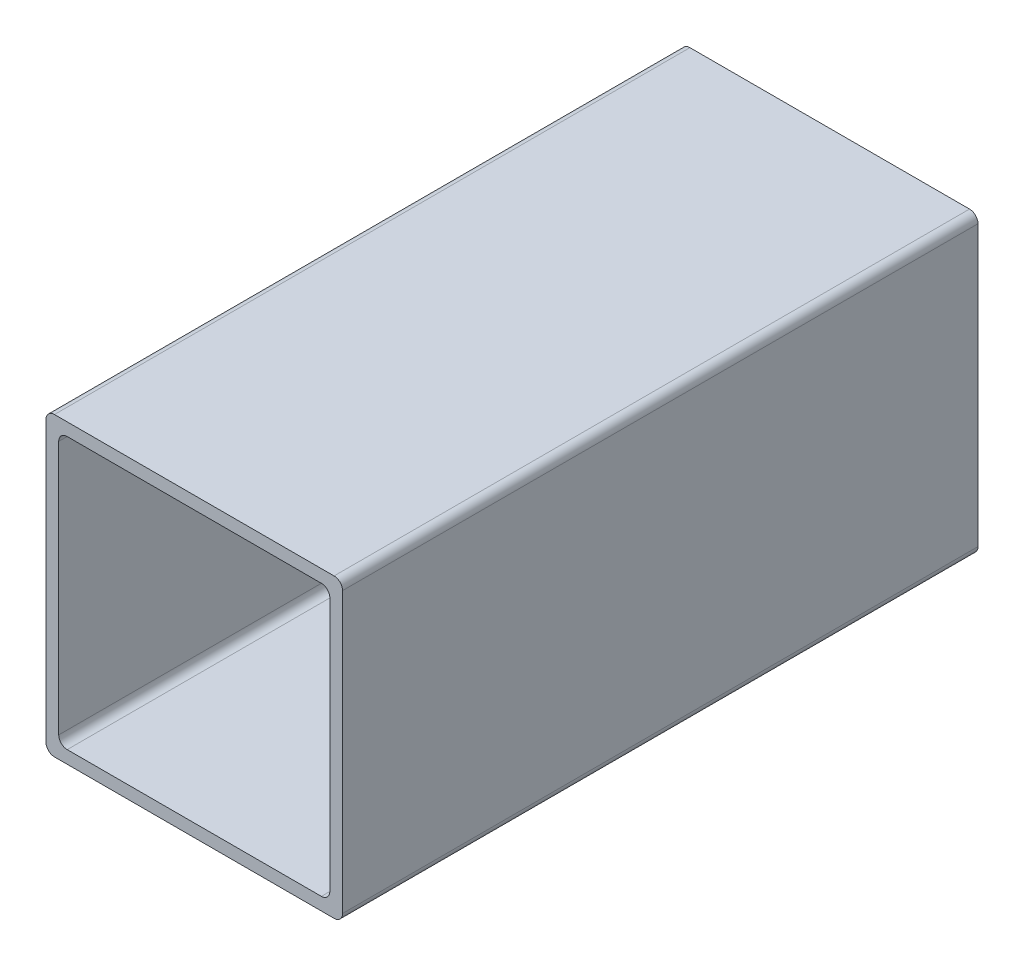
ISO-10303-21;
HEADER;
FILE_DESCRIPTION(('STEP AP214'),'2;1');
FILE_NAME('part.step','',(''),(''),'','','');
FILE_SCHEMA(('AUTOMOTIVE_DESIGN { 1 0 10303 214 1 1 1 1 }'));
ENDSEC;
DATA;
#1=APPLICATION_CONTEXT('core data for automotive mechanical design processes');
#2=APPLICATION_PROTOCOL_DEFINITION('international standard','automotive_design',2000,#1);
#3=PRODUCT_CONTEXT('',#1,'mechanical');
#4=PRODUCT('Part','Part','',(#3));
#5=PRODUCT_RELATED_PRODUCT_CATEGORY('part','',(#4));
#6=PRODUCT_DEFINITION_FORMATION('','',#4);
#7=PRODUCT_DEFINITION_CONTEXT('part definition',#1,'design');
#8=PRODUCT_DEFINITION('design','',#6,#7);
#9=PRODUCT_DEFINITION_SHAPE('','',#8);
#10=(LENGTH_UNIT() NAMED_UNIT(*) SI_UNIT(.MILLI.,.METRE.));
#11=(NAMED_UNIT(*) PLANE_ANGLE_UNIT() SI_UNIT($,.RADIAN.));
#12=(NAMED_UNIT(*) SI_UNIT($,.STERADIAN.) SOLID_ANGLE_UNIT());
#13=UNCERTAINTY_MEASURE_WITH_UNIT(LENGTH_MEASURE(1.E-05),#10,'distance_accuracy_value','');
#14=(GEOMETRIC_REPRESENTATION_CONTEXT(3) GLOBAL_UNCERTAINTY_ASSIGNED_CONTEXT((#13)) GLOBAL_UNIT_ASSIGNED_CONTEXT((#10,
#11,#12)) REPRESENTATION_CONTEXT('',''));
#15=CARTESIAN_POINT('',(0.,0.,0.));
#16=DIRECTION('',(0.,0.,1.));
#17=DIRECTION('',(1.,0.,0.));
#18=AXIS2_PLACEMENT_3D('',#15,#16,#17);
#19=CARTESIAN_POINT('',(0.,0.,150.));
#20=DIRECTION('',(0.,0.,1.));
#21=DIRECTION('',(1.,0.,0.));
#22=AXIS2_PLACEMENT_3D('',#19,#20,#21);
#23=PLANE('',#22);
#24=DIRECTION('',(1.,0.,0.));
#25=VECTOR('',#24,1.);
#26=CARTESIAN_POINT('',(-35.,-35.,150.));
#27=LINE('',#26,#25);
#28=CARTESIAN_POINT('',(-33.,-35.,150.));
#29=VERTEX_POINT('',#28);
#30=CARTESIAN_POINT('',(33.,-35.,150.));
#31=VERTEX_POINT('',#30);
#32=EDGE_CURVE('E186',#29,#31,#27,.T.);
#33=ORIENTED_EDGE('',*,*,#32,.T.);
#34=CARTESIAN_POINT('',(33.,-33.,150.));
#35=DIRECTION('',(0.,0.,1.));
#36=DIRECTION('',(1.,0.,0.));
#37=AXIS2_PLACEMENT_3D('',#34,#35,#36);
#38=CIRCLE('',#37,2.);
#39=CARTESIAN_POINT('',(35.,-33.,150.));
#40=VERTEX_POINT('',#39);
#41=EDGE_CURVE('E207',#31,#40,#38,.T.);
#42=ORIENTED_EDGE('',*,*,#41,.T.);
#43=DIRECTION('',(0.,1.,0.));
#44=VECTOR('',#43,1.);
#45=CARTESIAN_POINT('',(35.,35.,150.));
#46=LINE('',#45,#44);
#47=CARTESIAN_POINT('',(35.,33.,150.));
#48=VERTEX_POINT('',#47);
#49=EDGE_CURVE('E169',#40,#48,#46,.T.);
#50=ORIENTED_EDGE('',*,*,#49,.T.);
#51=CARTESIAN_POINT('',(33.,33.,150.));
#52=DIRECTION('',(0.,0.,1.));
#53=DIRECTION('',(1.,0.,0.));
#54=AXIS2_PLACEMENT_3D('',#51,#52,#53);
#55=CIRCLE('',#54,2.);
#56=CARTESIAN_POINT('',(33.,35.,150.));
#57=VERTEX_POINT('',#56);
#58=EDGE_CURVE('E205',#48,#57,#55,.T.);
#59=ORIENTED_EDGE('',*,*,#58,.T.);
#60=DIRECTION('',(-1.,0.,0.));
#61=VECTOR('',#60,1.);
#62=CARTESIAN_POINT('',(-35.,35.,150.));
#63=LINE('',#62,#61);
#64=CARTESIAN_POINT('',(-33.,35.,150.));
#65=VERTEX_POINT('',#64);
#66=EDGE_CURVE('E280',#57,#65,#63,.T.);
#67=ORIENTED_EDGE('',*,*,#66,.T.);
#68=CARTESIAN_POINT('',(-33.,33.,150.));
#69=DIRECTION('',(0.,0.,1.));
#70=DIRECTION('',(1.,0.,0.));
#71=AXIS2_PLACEMENT_3D('',#68,#69,#70);
#72=CIRCLE('',#71,2.);
#73=CARTESIAN_POINT('',(-35.,33.,150.));
#74=VERTEX_POINT('',#73);
#75=EDGE_CURVE('E203',#65,#74,#72,.T.);
#76=ORIENTED_EDGE('',*,*,#75,.T.);
#77=DIRECTION('',(0.,-1.,0.));
#78=VECTOR('',#77,1.);
#79=CARTESIAN_POINT('',(-35.,35.,150.));
#80=LINE('',#79,#78);
#81=CARTESIAN_POINT('',(-35.,-33.,150.));
#82=VERTEX_POINT('',#81);
#83=EDGE_CURVE('E282',#74,#82,#80,.T.);
#84=ORIENTED_EDGE('',*,*,#83,.T.);
#85=CARTESIAN_POINT('',(-33.,-33.,150.));
#86=DIRECTION('',(0.,0.,1.));
#87=DIRECTION('',(1.,0.,0.));
#88=AXIS2_PLACEMENT_3D('',#85,#86,#87);
#89=CIRCLE('',#88,2.);
#90=EDGE_CURVE('E201',#82,#29,#89,.T.);
#91=ORIENTED_EDGE('',*,*,#90,.T.);
#92=EDGE_LOOP('',(#33,#42,#50,#59,#67,#76,#84,#91));
#93=FACE_BOUND('',#92,.T.);
#94=DIRECTION('',(-1.,0.,0.));
#95=VECTOR('',#94,1.);
#96=CARTESIAN_POINT('',(-32.,32.,150.));
#97=LINE('',#96,#95);
#98=CARTESIAN_POINT('',(30.,32.,150.));
#99=VERTEX_POINT('',#98);
#100=CARTESIAN_POINT('',(-30.,32.,150.));
#101=VERTEX_POINT('',#100);
#102=EDGE_CURVE('E263',#99,#101,#97,.T.);
#103=ORIENTED_EDGE('',*,*,#102,.F.);
#104=CARTESIAN_POINT('',(30.,30.,150.));
#105=DIRECTION('',(0.,0.,1.));
#106=DIRECTION('',(1.,0.,0.));
#107=AXIS2_PLACEMENT_3D('',#104,#105,#106);
#108=CIRCLE('',#107,2.);
#109=CARTESIAN_POINT('',(32.,30.,150.));
#110=VERTEX_POINT('',#109);
#111=EDGE_CURVE('E247',#99,#110,#108,.F.);
#112=ORIENTED_EDGE('',*,*,#111,.T.);
#113=DIRECTION('',(0.,1.,0.));
#114=VECTOR('',#113,1.);
#115=CARTESIAN_POINT('',(32.,32.,150.));
#116=LINE('',#115,#114);
#117=CARTESIAN_POINT('',(32.,-30.,150.));
#118=VERTEX_POINT('',#117);
#119=EDGE_CURVE('E268',#118,#110,#116,.T.);
#120=ORIENTED_EDGE('',*,*,#119,.F.);
#121=CARTESIAN_POINT('',(30.,-30.,150.));
#122=DIRECTION('',(0.,0.,1.));
#123=DIRECTION('',(1.,0.,0.));
#124=AXIS2_PLACEMENT_3D('',#121,#122,#123);
#125=CIRCLE('',#124,2.);
#126=CARTESIAN_POINT('',(30.,-32.,150.));
#127=VERTEX_POINT('',#126);
#128=EDGE_CURVE('E240',#118,#127,#125,.F.);
#129=ORIENTED_EDGE('',*,*,#128,.T.);
#130=DIRECTION('',(1.,0.,0.));
#131=VECTOR('',#130,1.);
#132=CARTESIAN_POINT('',(-32.,-32.,150.));
#133=LINE('',#132,#131);
#134=CARTESIAN_POINT('',(-30.,-32.,150.));
#135=VERTEX_POINT('',#134);
#136=EDGE_CURVE('E177',#135,#127,#133,.T.);
#137=ORIENTED_EDGE('',*,*,#136,.F.);
#138=CARTESIAN_POINT('',(-30.,-30.,150.));
#139=DIRECTION('',(0.,0.,1.));
#140=DIRECTION('',(1.,0.,0.));
#141=AXIS2_PLACEMENT_3D('',#138,#139,#140);
#142=CIRCLE('',#141,2.);
#143=CARTESIAN_POINT('',(-32.,-30.,150.));
#144=VERTEX_POINT('',#143);
#145=EDGE_CURVE('E50',#135,#144,#142,.F.);
#146=ORIENTED_EDGE('',*,*,#145,.T.);
#147=DIRECTION('',(0.,-1.,0.));
#148=VECTOR('',#147,1.);
#149=CARTESIAN_POINT('',(-32.,32.,150.));
#150=LINE('',#149,#148);
#151=CARTESIAN_POINT('',(-32.,30.,150.));
#152=VERTEX_POINT('',#151);
#153=EDGE_CURVE('E183',#152,#144,#150,.T.);
#154=ORIENTED_EDGE('',*,*,#153,.F.);
#155=CARTESIAN_POINT('',(-30.,30.,150.));
#156=DIRECTION('',(0.,0.,1.));
#157=DIRECTION('',(1.,0.,0.));
#158=AXIS2_PLACEMENT_3D('',#155,#156,#157);
#159=CIRCLE('',#158,2.);
#160=EDGE_CURVE('E11',#152,#101,#159,.F.);
#161=ORIENTED_EDGE('',*,*,#160,.T.);
#162=EDGE_LOOP('',(#103,#112,#120,#129,#137,#146,#154,#161));
#163=FACE_BOUND('',#162,.T.);
#164=ADVANCED_FACE('F35',(#93,#163),#23,.T.);
#165=CARTESIAN_POINT('',(0.,0.,0.));
#166=DIRECTION('',(0.,0.,1.));
#167=DIRECTION('',(1.,0.,0.));
#168=AXIS2_PLACEMENT_3D('',#165,#166,#167);
#169=PLANE('',#168);
#170=DIRECTION('',(0.,1.,0.));
#171=VECTOR('',#170,1.);
#172=CARTESIAN_POINT('',(35.,35.,0.));
#173=LINE('',#172,#171);
#174=CARTESIAN_POINT('',(35.,-33.,0.));
#175=VERTEX_POINT('',#174);
#176=CARTESIAN_POINT('',(35.,33.,0.));
#177=VERTEX_POINT('',#176);
#178=EDGE_CURVE('E166',#175,#177,#173,.T.);
#179=ORIENTED_EDGE('',*,*,#178,.F.);
#180=CARTESIAN_POINT('',(33.,-33.,0.));
#181=DIRECTION('',(0.,0.,1.));
#182=DIRECTION('',(1.,0.,0.));
#183=AXIS2_PLACEMENT_3D('',#180,#181,#182);
#184=CIRCLE('',#183,2.);
#185=CARTESIAN_POINT('',(33.,-35.,0.));
#186=VERTEX_POINT('',#185);
#187=EDGE_CURVE('E149',#175,#186,#184,.F.);
#188=ORIENTED_EDGE('',*,*,#187,.T.);
#189=DIRECTION('',(1.,0.,0.));
#190=VECTOR('',#189,1.);
#191=CARTESIAN_POINT('',(-35.,-35.,0.));
#192=LINE('',#191,#190);
#193=CARTESIAN_POINT('',(-33.,-35.,0.));
#194=VERTEX_POINT('',#193);
#195=EDGE_CURVE('E191',#194,#186,#192,.T.);
#196=ORIENTED_EDGE('',*,*,#195,.F.);
#197=CARTESIAN_POINT('',(-33.,-33.,0.));
#198=DIRECTION('',(0.,0.,1.));
#199=DIRECTION('',(1.,0.,0.));
#200=AXIS2_PLACEMENT_3D('',#197,#198,#199);
#201=CIRCLE('',#200,2.);
#202=CARTESIAN_POINT('',(-35.,-33.,0.));
#203=VERTEX_POINT('',#202);
#204=EDGE_CURVE('E170',#194,#203,#201,.F.);
#205=ORIENTED_EDGE('',*,*,#204,.T.);
#206=DIRECTION('',(0.,-1.,0.));
#207=VECTOR('',#206,1.);
#208=CARTESIAN_POINT('',(-35.,35.,0.));
#209=LINE('',#208,#207);
#210=CARTESIAN_POINT('',(-35.,33.,0.));
#211=VERTEX_POINT('',#210);
#212=EDGE_CURVE('E180',#211,#203,#209,.T.);
#213=ORIENTED_EDGE('',*,*,#212,.F.);
#214=CARTESIAN_POINT('',(-33.,33.,0.));
#215=DIRECTION('',(0.,0.,1.));
#216=DIRECTION('',(1.,0.,0.));
#217=AXIS2_PLACEMENT_3D('',#214,#215,#216);
#218=CIRCLE('',#217,2.);
#219=CARTESIAN_POINT('',(-33.,35.,0.));
#220=VERTEX_POINT('',#219);
#221=EDGE_CURVE('E195',#211,#220,#218,.F.);
#222=ORIENTED_EDGE('',*,*,#221,.T.);
#223=DIRECTION('',(-1.,0.,0.));
#224=VECTOR('',#223,1.);
#225=CARTESIAN_POINT('',(-35.,35.,0.));
#226=LINE('',#225,#224);
#227=CARTESIAN_POINT('',(33.,35.,0.));
#228=VERTEX_POINT('',#227);
#229=EDGE_CURVE('E176',#228,#220,#226,.T.);
#230=ORIENTED_EDGE('',*,*,#229,.F.);
#231=CARTESIAN_POINT('',(33.,33.,0.));
#232=DIRECTION('',(0.,0.,1.));
#233=DIRECTION('',(1.,0.,0.));
#234=AXIS2_PLACEMENT_3D('',#231,#232,#233);
#235=CIRCLE('',#234,2.);
#236=EDGE_CURVE('E160',#228,#177,#235,.F.);
#237=ORIENTED_EDGE('',*,*,#236,.T.);
#238=EDGE_LOOP('',(#179,#188,#196,#205,#213,#222,#230,#237));
#239=FACE_BOUND('',#238,.T.);
#240=DIRECTION('',(1.,0.,0.));
#241=VECTOR('',#240,1.);
#242=CARTESIAN_POINT('',(-32.,-32.,0.));
#243=LINE('',#242,#241);
#244=CARTESIAN_POINT('',(-30.,-32.,0.));
#245=VERTEX_POINT('',#244);
#246=CARTESIAN_POINT('',(30.,-32.,0.));
#247=VERTEX_POINT('',#246);
#248=EDGE_CURVE('E258',#245,#247,#243,.T.);
#249=ORIENTED_EDGE('',*,*,#248,.T.);
#250=CARTESIAN_POINT('',(30.,-30.,0.));
#251=DIRECTION('',(0.,0.,1.));
#252=DIRECTION('',(1.,0.,0.));
#253=AXIS2_PLACEMENT_3D('',#250,#251,#252);
#254=CIRCLE('',#253,2.);
#255=CARTESIAN_POINT('',(32.,-30.,0.));
#256=VERTEX_POINT('',#255);
#257=EDGE_CURVE('E238',#247,#256,#254,.T.);
#258=ORIENTED_EDGE('',*,*,#257,.T.);
#259=DIRECTION('',(0.,1.,0.));
#260=VECTOR('',#259,1.);
#261=CARTESIAN_POINT('',(32.,32.,0.));
#262=LINE('',#261,#260);
#263=CARTESIAN_POINT('',(32.,30.,0.));
#264=VERTEX_POINT('',#263);
#265=EDGE_CURVE('E274',#256,#264,#262,.T.);
#266=ORIENTED_EDGE('',*,*,#265,.T.);
#267=CARTESIAN_POINT('',(30.,30.,0.));
#268=DIRECTION('',(0.,0.,1.));
#269=DIRECTION('',(1.,0.,0.));
#270=AXIS2_PLACEMENT_3D('',#267,#268,#269);
#271=CIRCLE('',#270,2.);
#272=CARTESIAN_POINT('',(30.,32.,0.));
#273=VERTEX_POINT('',#272);
#274=EDGE_CURVE('E245',#264,#273,#271,.T.);
#275=ORIENTED_EDGE('',*,*,#274,.T.);
#276=DIRECTION('',(-1.,0.,0.));
#277=VECTOR('',#276,1.);
#278=CARTESIAN_POINT('',(-32.,32.,0.));
#279=LINE('',#278,#277);
#280=CARTESIAN_POINT('',(-30.,32.,0.));
#281=VERTEX_POINT('',#280);
#282=EDGE_CURVE('E253',#273,#281,#279,.T.);
#283=ORIENTED_EDGE('',*,*,#282,.T.);
#284=CARTESIAN_POINT('',(-30.,30.,0.));
#285=DIRECTION('',(0.,0.,1.));
#286=DIRECTION('',(1.,0.,0.));
#287=AXIS2_PLACEMENT_3D('',#284,#285,#286);
#288=CIRCLE('',#287,2.);
#289=CARTESIAN_POINT('',(-32.,30.,0.));
#290=VERTEX_POINT('',#289);
#291=EDGE_CURVE('E43',#281,#290,#288,.T.);
#292=ORIENTED_EDGE('',*,*,#291,.T.);
#293=DIRECTION('',(0.,-1.,0.));
#294=VECTOR('',#293,1.);
#295=CARTESIAN_POINT('',(-32.,32.,0.));
#296=LINE('',#295,#294);
#297=CARTESIAN_POINT('',(-32.,-30.,0.));
#298=VERTEX_POINT('',#297);
#299=EDGE_CURVE('E251',#290,#298,#296,.T.);
#300=ORIENTED_EDGE('',*,*,#299,.T.);
#301=CARTESIAN_POINT('',(-30.,-30.,0.));
#302=DIRECTION('',(0.,0.,1.));
#303=DIRECTION('',(1.,0.,0.));
#304=AXIS2_PLACEMENT_3D('',#301,#302,#303);
#305=CIRCLE('',#304,2.);
#306=EDGE_CURVE('E242',#298,#245,#305,.T.);
#307=ORIENTED_EDGE('',*,*,#306,.T.);
#308=EDGE_LOOP('',(#249,#258,#266,#275,#283,#292,#300,#307));
#309=FACE_BOUND('',#308,.T.);
#310=ADVANCED_FACE('F173',(#239,#309),#169,.F.);
#311=CARTESIAN_POINT('',(35.,35.,150.));
#312=DIRECTION('',(-1.,0.,0.));
#313=DIRECTION('',(0.,-1.,0.));
#314=AXIS2_PLACEMENT_3D('',#311,#312,#313);
#315=PLANE('',#314);
#316=ORIENTED_EDGE('',*,*,#49,.F.);
#317=DIRECTION('',(0.,0.,-1.));
#318=VECTOR('',#317,1.);
#319=CARTESIAN_POINT('',(35.,-33.,150.));
#320=LINE('',#319,#318);
#321=EDGE_CURVE('E153',#40,#175,#320,.T.);
#322=ORIENTED_EDGE('',*,*,#321,.T.);
#323=ORIENTED_EDGE('',*,*,#178,.T.);
#324=DIRECTION('',(0.,0.,-1.));
#325=VECTOR('',#324,1.);
#326=CARTESIAN_POINT('',(35.,33.,150.));
#327=LINE('',#326,#325);
#328=EDGE_CURVE('E171',#177,#48,#327,.F.);
#329=ORIENTED_EDGE('',*,*,#328,.T.);
#330=EDGE_LOOP('',(#316,#322,#323,#329));
#331=FACE_BOUND('',#330,.T.);
#332=ADVANCED_FACE('F165',(#331),#315,.F.);
#333=CARTESIAN_POINT('',(-35.,35.,150.));
#334=DIRECTION('',(0.,-1.,0.));
#335=DIRECTION('',(0.,0.,-1.));
#336=AXIS2_PLACEMENT_3D('',#333,#334,#335);
#337=PLANE('',#336);
#338=ORIENTED_EDGE('',*,*,#66,.F.);
#339=DIRECTION('',(0.,0.,-1.));
#340=VECTOR('',#339,1.);
#341=CARTESIAN_POINT('',(33.,35.,150.));
#342=LINE('',#341,#340);
#343=EDGE_CURVE('E211',#57,#228,#342,.T.);
#344=ORIENTED_EDGE('',*,*,#343,.T.);
#345=ORIENTED_EDGE('',*,*,#229,.T.);
#346=DIRECTION('',(0.,0.,-1.));
#347=VECTOR('',#346,1.);
#348=CARTESIAN_POINT('',(-33.,35.,150.));
#349=LINE('',#348,#347);
#350=EDGE_CURVE('E209',#220,#65,#349,.F.);
#351=ORIENTED_EDGE('',*,*,#350,.T.);
#352=EDGE_LOOP('',(#338,#344,#345,#351));
#353=FACE_BOUND('',#352,.T.);
#354=ADVANCED_FACE('F305',(#353),#337,.F.);
#355=CARTESIAN_POINT('',(-35.,35.,150.));
#356=DIRECTION('',(1.,0.,0.));
#357=DIRECTION('',(0.,1.,0.));
#358=AXIS2_PLACEMENT_3D('',#355,#356,#357);
#359=PLANE('',#358);
#360=ORIENTED_EDGE('',*,*,#83,.F.);
#361=DIRECTION('',(0.,0.,-1.));
#362=VECTOR('',#361,1.);
#363=CARTESIAN_POINT('',(-35.,33.,150.));
#364=LINE('',#363,#362);
#365=EDGE_CURVE('E216',#74,#211,#364,.T.);
#366=ORIENTED_EDGE('',*,*,#365,.T.);
#367=ORIENTED_EDGE('',*,*,#212,.T.);
#368=DIRECTION('',(0.,0.,-1.));
#369=VECTOR('',#368,1.);
#370=CARTESIAN_POINT('',(-35.,-33.,150.));
#371=LINE('',#370,#369);
#372=EDGE_CURVE('E214',#203,#82,#371,.F.);
#373=ORIENTED_EDGE('',*,*,#372,.T.);
#374=EDGE_LOOP('',(#360,#366,#367,#373));
#375=FACE_BOUND('',#374,.T.);
#376=ADVANCED_FACE('F297',(#375),#359,.F.);
#377=CARTESIAN_POINT('',(-35.,-35.,150.));
#378=DIRECTION('',(0.,1.,0.));
#379=DIRECTION('',(0.,0.,1.));
#380=AXIS2_PLACEMENT_3D('',#377,#378,#379);
#381=PLANE('',#380);
#382=ORIENTED_EDGE('',*,*,#195,.T.);
#383=DIRECTION('',(0.,0.,-1.));
#384=VECTOR('',#383,1.);
#385=CARTESIAN_POINT('',(33.,-35.,150.));
#386=LINE('',#385,#384);
#387=EDGE_CURVE('E154',#186,#31,#386,.F.);
#388=ORIENTED_EDGE('',*,*,#387,.T.);
#389=ORIENTED_EDGE('',*,*,#32,.F.);
#390=DIRECTION('',(0.,0.,-1.));
#391=VECTOR('',#390,1.);
#392=CARTESIAN_POINT('',(-33.,-35.,150.));
#393=LINE('',#392,#391);
#394=EDGE_CURVE('E159',#29,#194,#393,.T.);
#395=ORIENTED_EDGE('',*,*,#394,.T.);
#396=EDGE_LOOP('',(#382,#388,#389,#395));
#397=FACE_BOUND('',#396,.T.);
#398=ADVANCED_FACE('F291',(#397),#381,.F.);
#399=CARTESIAN_POINT('',(32.,32.,150.));
#400=DIRECTION('',(-1.,0.,0.));
#401=DIRECTION('',(0.,-1.,0.));
#402=AXIS2_PLACEMENT_3D('',#399,#400,#401);
#403=PLANE('',#402);
#404=ORIENTED_EDGE('',*,*,#265,.F.);
#405=DIRECTION('',(0.,0.,-1.));
#406=VECTOR('',#405,1.);
#407=CARTESIAN_POINT('',(32.,-30.,150.));
#408=LINE('',#407,#406);
#409=EDGE_CURVE('E227',#256,#118,#408,.F.);
#410=ORIENTED_EDGE('',*,*,#409,.T.);
#411=ORIENTED_EDGE('',*,*,#119,.T.);
#412=DIRECTION('',(0.,0.,-1.));
#413=VECTOR('',#412,1.);
#414=CARTESIAN_POINT('',(32.,30.,0.));
#415=LINE('',#414,#413);
#416=EDGE_CURVE('E224',#110,#264,#415,.T.);
#417=ORIENTED_EDGE('',*,*,#416,.T.);
#418=EDGE_LOOP('',(#404,#410,#411,#417));
#419=FACE_BOUND('',#418,.T.);
#420=ADVANCED_FACE('F326',(#419),#403,.T.);
#421=CARTESIAN_POINT('',(-32.,32.,150.));
#422=DIRECTION('',(0.,-1.,0.));
#423=DIRECTION('',(0.,0.,-1.));
#424=AXIS2_PLACEMENT_3D('',#421,#422,#423);
#425=PLANE('',#424);
#426=ORIENTED_EDGE('',*,*,#282,.F.);
#427=DIRECTION('',(0.,0.,-1.));
#428=VECTOR('',#427,1.);
#429=CARTESIAN_POINT('',(30.,32.,150.));
#430=LINE('',#429,#428);
#431=EDGE_CURVE('E236',#273,#99,#430,.F.);
#432=ORIENTED_EDGE('',*,*,#431,.T.);
#433=ORIENTED_EDGE('',*,*,#102,.T.);
#434=DIRECTION('',(0.,0.,-1.));
#435=VECTOR('',#434,1.);
#436=CARTESIAN_POINT('',(-30.,32.,0.));
#437=LINE('',#436,#435);
#438=EDGE_CURVE('E233',#101,#281,#437,.T.);
#439=ORIENTED_EDGE('',*,*,#438,.T.);
#440=EDGE_LOOP('',(#426,#432,#433,#439));
#441=FACE_BOUND('',#440,.T.);
#442=ADVANCED_FACE('F266',(#441),#425,.T.);
#443=CARTESIAN_POINT('',(-32.,32.,150.));
#444=DIRECTION('',(1.,0.,0.));
#445=DIRECTION('',(0.,1.,0.));
#446=AXIS2_PLACEMENT_3D('',#443,#444,#445);
#447=PLANE('',#446);
#448=ORIENTED_EDGE('',*,*,#153,.T.);
#449=DIRECTION('',(0.,0.,-1.));
#450=VECTOR('',#449,1.);
#451=CARTESIAN_POINT('',(-32.,-30.,0.));
#452=LINE('',#451,#450);
#453=EDGE_CURVE('E230',#144,#298,#452,.T.);
#454=ORIENTED_EDGE('',*,*,#453,.T.);
#455=ORIENTED_EDGE('',*,*,#299,.F.);
#456=DIRECTION('',(0.,0.,-1.));
#457=VECTOR('',#456,1.);
#458=CARTESIAN_POINT('',(-32.,30.,150.));
#459=LINE('',#458,#457);
#460=EDGE_CURVE('E57',#290,#152,#459,.F.);
#461=ORIENTED_EDGE('',*,*,#460,.T.);
#462=EDGE_LOOP('',(#448,#454,#455,#461));
#463=FACE_BOUND('',#462,.T.);
#464=ADVANCED_FACE('F256',(#463),#447,.T.);
#465=CARTESIAN_POINT('',(-32.,-32.,150.));
#466=DIRECTION('',(0.,1.,0.));
#467=DIRECTION('',(-1.,0.,0.));
#468=AXIS2_PLACEMENT_3D('',#465,#466,#467);
#469=PLANE('',#468);
#470=ORIENTED_EDGE('',*,*,#136,.T.);
#471=DIRECTION('',(0.,0.,-1.));
#472=VECTOR('',#471,1.);
#473=CARTESIAN_POINT('',(30.,-32.,0.));
#474=LINE('',#473,#472);
#475=EDGE_CURVE('E221',#127,#247,#474,.T.);
#476=ORIENTED_EDGE('',*,*,#475,.T.);
#477=ORIENTED_EDGE('',*,*,#248,.F.);
#478=DIRECTION('',(0.,0.,-1.));
#479=VECTOR('',#478,1.);
#480=CARTESIAN_POINT('',(-30.,-32.,150.));
#481=LINE('',#480,#479);
#482=EDGE_CURVE('E219',#245,#135,#481,.F.);
#483=ORIENTED_EDGE('',*,*,#482,.T.);
#484=EDGE_LOOP('',(#470,#476,#477,#483));
#485=FACE_BOUND('',#484,.T.);
#486=ADVANCED_FACE('F317',(#485),#469,.T.);
#487=CARTESIAN_POINT('',(33.,-33.,150.));
#488=DIRECTION('',(0.,0.,-1.));
#489=DIRECTION('',(-1.,0.,0.));
#490=AXIS2_PLACEMENT_3D('',#487,#488,#489);
#491=CYLINDRICAL_SURFACE('',#490,2.);
#492=ORIENTED_EDGE('',*,*,#41,.F.);
#493=ORIENTED_EDGE('',*,*,#387,.F.);
#494=ORIENTED_EDGE('',*,*,#187,.F.);
#495=ORIENTED_EDGE('',*,*,#321,.F.);
#496=EDGE_LOOP('',(#492,#493,#494,#495));
#497=FACE_BOUND('',#496,.T.);
#498=ADVANCED_FACE('F152',(#497),#491,.T.);
#499=CARTESIAN_POINT('',(33.,33.,150.));
#500=DIRECTION('',(0.,0.,-1.));
#501=DIRECTION('',(-1.,0.,0.));
#502=AXIS2_PLACEMENT_3D('',#499,#500,#501);
#503=CYLINDRICAL_SURFACE('',#502,2.);
#504=ORIENTED_EDGE('',*,*,#58,.F.);
#505=ORIENTED_EDGE('',*,*,#328,.F.);
#506=ORIENTED_EDGE('',*,*,#236,.F.);
#507=ORIENTED_EDGE('',*,*,#343,.F.);
#508=EDGE_LOOP('',(#504,#505,#506,#507));
#509=FACE_BOUND('',#508,.T.);
#510=ADVANCED_FACE('F309',(#509),#503,.T.);
#511=CARTESIAN_POINT('',(-33.,33.,150.));
#512=DIRECTION('',(0.,0.,-1.));
#513=DIRECTION('',(-1.,0.,0.));
#514=AXIS2_PLACEMENT_3D('',#511,#512,#513);
#515=CYLINDRICAL_SURFACE('',#514,2.);
#516=ORIENTED_EDGE('',*,*,#75,.F.);
#517=ORIENTED_EDGE('',*,*,#350,.F.);
#518=ORIENTED_EDGE('',*,*,#221,.F.);
#519=ORIENTED_EDGE('',*,*,#365,.F.);
#520=EDGE_LOOP('',(#516,#517,#518,#519));
#521=FACE_BOUND('',#520,.T.);
#522=ADVANCED_FACE('F301',(#521),#515,.T.);
#523=CARTESIAN_POINT('',(-33.,-33.,150.));
#524=DIRECTION('',(0.,0.,-1.));
#525=DIRECTION('',(-1.,0.,0.));
#526=AXIS2_PLACEMENT_3D('',#523,#524,#525);
#527=CYLINDRICAL_SURFACE('',#526,2.);
#528=ORIENTED_EDGE('',*,*,#90,.F.);
#529=ORIENTED_EDGE('',*,*,#372,.F.);
#530=ORIENTED_EDGE('',*,*,#204,.F.);
#531=ORIENTED_EDGE('',*,*,#394,.F.);
#532=EDGE_LOOP('',(#528,#529,#530,#531));
#533=FACE_BOUND('',#532,.T.);
#534=ADVANCED_FACE('F293',(#533),#527,.T.);
#535=CARTESIAN_POINT('',(30.,-30.,150.));
#536=DIRECTION('',(0.,0.,1.));
#537=DIRECTION('',(1.,0.,0.));
#538=AXIS2_PLACEMENT_3D('',#535,#536,#537);
#539=CYLINDRICAL_SURFACE('',#538,2.);
#540=ORIENTED_EDGE('',*,*,#128,.F.);
#541=ORIENTED_EDGE('',*,*,#409,.F.);
#542=ORIENTED_EDGE('',*,*,#257,.F.);
#543=ORIENTED_EDGE('',*,*,#475,.F.);
#544=EDGE_LOOP('',(#540,#541,#542,#543));
#545=FACE_BOUND('',#544,.T.);
#546=ADVANCED_FACE('F399',(#545),#539,.F.);
#547=CARTESIAN_POINT('',(-30.,-30.,150.));
#548=DIRECTION('',(0.,0.,1.));
#549=DIRECTION('',(1.,0.,0.));
#550=AXIS2_PLACEMENT_3D('',#547,#548,#549);
#551=CYLINDRICAL_SURFACE('',#550,2.);
#552=ORIENTED_EDGE('',*,*,#145,.F.);
#553=ORIENTED_EDGE('',*,*,#482,.F.);
#554=ORIENTED_EDGE('',*,*,#306,.F.);
#555=ORIENTED_EDGE('',*,*,#453,.F.);
#556=EDGE_LOOP('',(#552,#553,#554,#555));
#557=FACE_BOUND('',#556,.T.);
#558=ADVANCED_FACE('F408',(#557),#551,.F.);
#559=CARTESIAN_POINT('',(30.,30.,150.));
#560=DIRECTION('',(0.,0.,1.));
#561=DIRECTION('',(1.,0.,0.));
#562=AXIS2_PLACEMENT_3D('',#559,#560,#561);
#563=CYLINDRICAL_SURFACE('',#562,2.);
#564=ORIENTED_EDGE('',*,*,#111,.F.);
#565=ORIENTED_EDGE('',*,*,#431,.F.);
#566=ORIENTED_EDGE('',*,*,#274,.F.);
#567=ORIENTED_EDGE('',*,*,#416,.F.);
#568=EDGE_LOOP('',(#564,#565,#566,#567));
#569=FACE_BOUND('',#568,.T.);
#570=ADVANCED_FACE('F418',(#569),#563,.F.);
#571=CARTESIAN_POINT('',(-30.,30.,150.));
#572=DIRECTION('',(0.,0.,1.));
#573=DIRECTION('',(1.,0.,0.));
#574=AXIS2_PLACEMENT_3D('',#571,#572,#573);
#575=CYLINDRICAL_SURFACE('',#574,2.);
#576=ORIENTED_EDGE('',*,*,#160,.F.);
#577=ORIENTED_EDGE('',*,*,#460,.F.);
#578=ORIENTED_EDGE('',*,*,#291,.F.);
#579=ORIENTED_EDGE('',*,*,#438,.F.);
#580=EDGE_LOOP('',(#576,#577,#578,#579));
#581=FACE_BOUND('',#580,.T.);
#582=ADVANCED_FACE('F37',(#581),#575,.F.);
#583=CLOSED_SHELL('',(#164,#310,#332,#354,#376,#398,#420,#442,#464,#486,#498,#510,#522,#534,
#546,#558,#570,#582));
#584=MANIFOLD_SOLID_BREP('B2',#583);
#585=ADVANCED_BREP_SHAPE_REPRESENTATION('',(#18,#584),#14);
#586=SHAPE_DEFINITION_REPRESENTATION(#9,#585);
ENDSEC;
END-ISO-10303-21;
